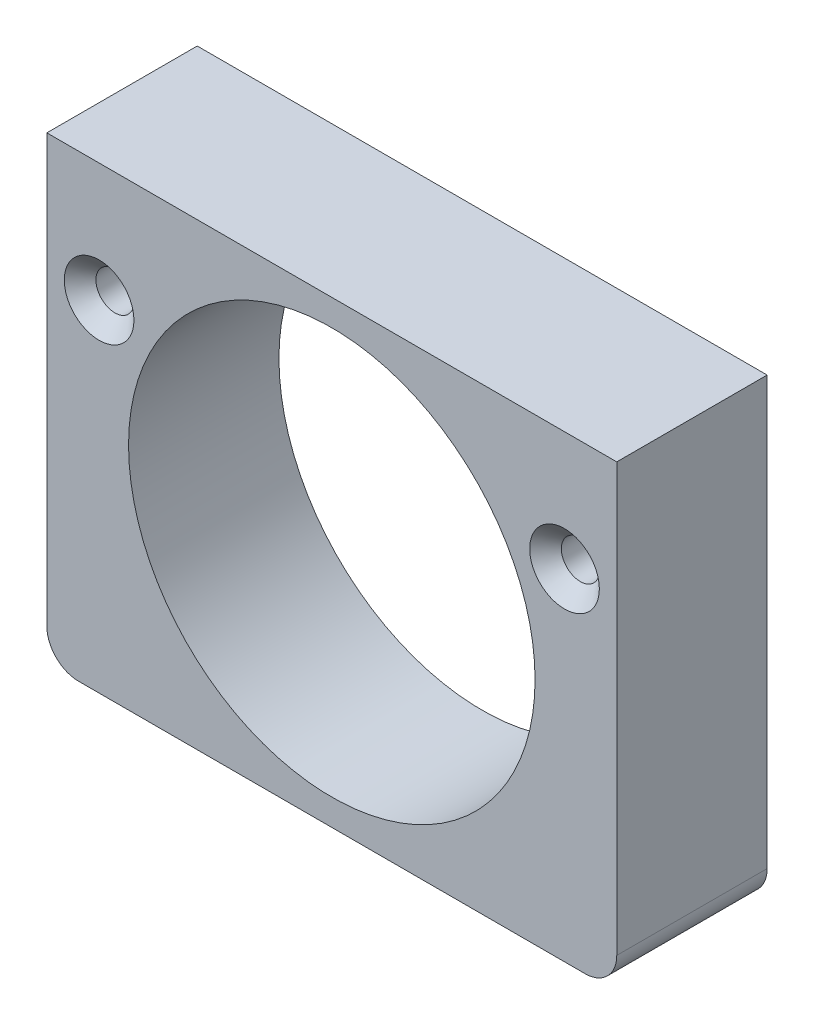
ISO-10303-21;
HEADER;
FILE_DESCRIPTION(('STEP AP214'),'2;1');
FILE_NAME('part.step','',(''),(''),'','','');
FILE_SCHEMA(('AUTOMOTIVE_DESIGN { 1 0 10303 214 1 1 1 1 }'));
ENDSEC;
DATA;
#1=APPLICATION_CONTEXT('core data for automotive mechanical design processes');
#2=APPLICATION_PROTOCOL_DEFINITION('international standard','automotive_design',2000,#1);
#3=PRODUCT_CONTEXT('',#1,'mechanical');
#4=PRODUCT('Part','Part','',(#3));
#5=PRODUCT_RELATED_PRODUCT_CATEGORY('part','',(#4));
#6=PRODUCT_DEFINITION_FORMATION('','',#4);
#7=PRODUCT_DEFINITION_CONTEXT('part definition',#1,'design');
#8=PRODUCT_DEFINITION('design','',#6,#7);
#9=PRODUCT_DEFINITION_SHAPE('','',#8);
#10=(LENGTH_UNIT() NAMED_UNIT(*) SI_UNIT(.MILLI.,.METRE.));
#11=(NAMED_UNIT(*) PLANE_ANGLE_UNIT() SI_UNIT($,.RADIAN.));
#12=(NAMED_UNIT(*) SI_UNIT($,.STERADIAN.) SOLID_ANGLE_UNIT());
#13=UNCERTAINTY_MEASURE_WITH_UNIT(LENGTH_MEASURE(1.E-05),#10,'distance_accuracy_value','');
#14=(GEOMETRIC_REPRESENTATION_CONTEXT(3) GLOBAL_UNCERTAINTY_ASSIGNED_CONTEXT((#13)) GLOBAL_UNIT_ASSIGNED_CONTEXT((#10,
#11,#12)) REPRESENTATION_CONTEXT('',''));
#15=CARTESIAN_POINT('',(0.,0.,0.));
#16=DIRECTION('',(0.,0.,1.));
#17=DIRECTION('',(1.,0.,0.));
#18=AXIS2_PLACEMENT_3D('',#15,#16,#17);
#19=CARTESIAN_POINT('',(-16.,-12.5,9.5));
#20=DIRECTION('',(0.,0.,-1.));
#21=DIRECTION('',(-1.,0.,0.));
#22=AXIS2_PLACEMENT_3D('',#19,#20,#21);
#23=PLANE('',#22);
#24=CARTESIAN_POINT('',(14.7,7.,9.5));
#25=DIRECTION('',(0.,0.,1.));
#26=DIRECTION('',(1.,0.,0.));
#27=AXIS2_PLACEMENT_3D('',#24,#25,#26);
#28=CIRCLE('',#27,2.2);
#29=CARTESIAN_POINT('',(16.9,7.,9.5));
#30=VERTEX_POINT('',#29);
#31=EDGE_CURVE('E199',#30,#30,#28,.T.);
#32=ORIENTED_EDGE('',*,*,#31,.F.);
#33=EDGE_LOOP('',(#32));
#34=FACE_BOUND('',#33,.T.);
#35=CARTESIAN_POINT('',(0.,0.,9.5));
#36=DIRECTION('',(0.,0.,1.));
#37=DIRECTION('',(1.,0.,0.));
#38=AXIS2_PLACEMENT_3D('',#35,#36,#37);
#39=CIRCLE('',#38,12.8397);
#40=CARTESIAN_POINT('',(12.8397,0.,9.5));
#41=VERTEX_POINT('',#40);
#42=EDGE_CURVE('E125',#41,#41,#39,.T.);
#43=ORIENTED_EDGE('',*,*,#42,.F.);
#44=EDGE_LOOP('',(#43));
#45=FACE_BOUND('',#44,.T.);
#46=DIRECTION('',(0.,1.,0.));
#47=VECTOR('',#46,1.);
#48=CARTESIAN_POINT('',(18.,-12.5,9.5));
#49=LINE('',#48,#47);
#50=CARTESIAN_POINT('',(18.,-12.5,9.5));
#51=VERTEX_POINT('',#50);
#52=CARTESIAN_POINT('',(18.,14.5,9.5));
#53=VERTEX_POINT('',#52);
#54=EDGE_CURVE('E132',#51,#53,#49,.T.);
#55=ORIENTED_EDGE('',*,*,#54,.T.);
#56=DIRECTION('',(-1.,0.,0.));
#57=VECTOR('',#56,1.);
#58=CARTESIAN_POINT('',(-18.,14.5,9.5));
#59=LINE('',#58,#57);
#60=CARTESIAN_POINT('',(-18.,14.5,9.5));
#61=VERTEX_POINT('',#60);
#62=EDGE_CURVE('E90',#53,#61,#59,.T.);
#63=ORIENTED_EDGE('',*,*,#62,.T.);
#64=DIRECTION('',(0.,-1.,0.));
#65=VECTOR('',#64,1.);
#66=CARTESIAN_POINT('',(-18.,-12.5,9.5));
#67=LINE('',#66,#65);
#68=CARTESIAN_POINT('',(-18.,-12.5,9.5));
#69=VERTEX_POINT('',#68);
#70=EDGE_CURVE('E103',#61,#69,#67,.T.);
#71=ORIENTED_EDGE('',*,*,#70,.T.);
#72=CARTESIAN_POINT('',(-16.,-12.5,9.5));
#73=DIRECTION('',(0.,0.,1.));
#74=DIRECTION('',(-1.,0.,0.));
#75=AXIS2_PLACEMENT_3D('',#72,#73,#74);
#76=CIRCLE('',#75,2.);
#77=CARTESIAN_POINT('',(-16.,-14.5,9.5));
#78=VERTEX_POINT('',#77);
#79=EDGE_CURVE('E97',#69,#78,#76,.T.);
#80=ORIENTED_EDGE('',*,*,#79,.T.);
#81=DIRECTION('',(1.,0.,0.));
#82=VECTOR('',#81,1.);
#83=CARTESIAN_POINT('',(-16.,-14.5,9.5));
#84=LINE('',#83,#82);
#85=CARTESIAN_POINT('',(16.,-14.5,9.5));
#86=VERTEX_POINT('',#85);
#87=EDGE_CURVE('E101',#78,#86,#84,.T.);
#88=ORIENTED_EDGE('',*,*,#87,.T.);
#89=CARTESIAN_POINT('',(16.,-12.5,9.5));
#90=DIRECTION('',(0.,0.,1.));
#91=DIRECTION('',(1.,0.,0.));
#92=AXIS2_PLACEMENT_3D('',#89,#90,#91);
#93=CIRCLE('',#92,2.);
#94=EDGE_CURVE('E53',#86,#51,#93,.T.);
#95=ORIENTED_EDGE('',*,*,#94,.T.);
#96=EDGE_LOOP('',(#55,#63,#71,#80,#88,#95));
#97=FACE_BOUND('',#96,.T.);
#98=CARTESIAN_POINT('',(-14.7,7.,9.5));
#99=DIRECTION('',(0.,0.,1.));
#100=DIRECTION('',(1.,0.,0.));
#101=AXIS2_PLACEMENT_3D('',#98,#99,#100);
#102=CIRCLE('',#101,2.2);
#103=CARTESIAN_POINT('',(-12.5,7.,9.5));
#104=VERTEX_POINT('',#103);
#105=EDGE_CURVE('E192',#104,#104,#102,.T.);
#106=ORIENTED_EDGE('',*,*,#105,.F.);
#107=EDGE_LOOP('',(#106));
#108=FACE_BOUND('',#107,.T.);
#109=ADVANCED_FACE('F36',(#34,#45,#97,#108),#23,.F.);
#110=CARTESIAN_POINT('',(18.,-12.5,9.5));
#111=DIRECTION('',(-1.,0.,0.));
#112=DIRECTION('',(0.,-1.,0.));
#113=AXIS2_PLACEMENT_3D('',#110,#111,#112);
#114=PLANE('',#113);
#115=DIRECTION('',(0.,1.,0.));
#116=VECTOR('',#115,1.);
#117=CARTESIAN_POINT('',(18.,-12.5,0.));
#118=LINE('',#117,#116);
#119=CARTESIAN_POINT('',(18.,-12.5,0.));
#120=VERTEX_POINT('',#119);
#121=CARTESIAN_POINT('',(18.,14.5,0.));
#122=VERTEX_POINT('',#121);
#123=EDGE_CURVE('E121',#120,#122,#118,.T.);
#124=ORIENTED_EDGE('',*,*,#123,.T.);
#125=DIRECTION('',(0.,0.,-1.));
#126=VECTOR('',#125,1.);
#127=CARTESIAN_POINT('',(18.,14.5,9.5));
#128=LINE('',#127,#126);
#129=EDGE_CURVE('E11',#53,#122,#128,.T.);
#130=ORIENTED_EDGE('',*,*,#129,.F.);
#131=ORIENTED_EDGE('',*,*,#54,.F.);
#132=DIRECTION('',(0.,0.,-1.));
#133=VECTOR('',#132,1.);
#134=CARTESIAN_POINT('',(18.,-12.5,9.5));
#135=LINE('',#134,#133);
#136=EDGE_CURVE('E117',#51,#120,#135,.T.);
#137=ORIENTED_EDGE('',*,*,#136,.T.);
#138=EDGE_LOOP('',(#124,#130,#131,#137));
#139=FACE_BOUND('',#138,.T.);
#140=ADVANCED_FACE('F38',(#139),#114,.F.);
#141=CARTESIAN_POINT('',(-18.,14.5,9.5));
#142=DIRECTION('',(0.,-1.,0.));
#143=DIRECTION('',(0.,0.,-1.));
#144=AXIS2_PLACEMENT_3D('',#141,#142,#143);
#145=PLANE('',#144);
#146=DIRECTION('',(-1.,0.,0.));
#147=VECTOR('',#146,1.);
#148=CARTESIAN_POINT('',(-18.,14.5,0.));
#149=LINE('',#148,#147);
#150=CARTESIAN_POINT('',(-18.,14.5,0.));
#151=VERTEX_POINT('',#150);
#152=EDGE_CURVE('E124',#122,#151,#149,.T.);
#153=ORIENTED_EDGE('',*,*,#152,.T.);
#154=DIRECTION('',(0.,0.,-1.));
#155=VECTOR('',#154,1.);
#156=CARTESIAN_POINT('',(-18.,14.5,9.5));
#157=LINE('',#156,#155);
#158=EDGE_CURVE('E45',#61,#151,#157,.T.);
#159=ORIENTED_EDGE('',*,*,#158,.F.);
#160=ORIENTED_EDGE('',*,*,#62,.F.);
#161=ORIENTED_EDGE('',*,*,#129,.T.);
#162=EDGE_LOOP('',(#153,#159,#160,#161));
#163=FACE_BOUND('',#162,.T.);
#164=ADVANCED_FACE('F162',(#163),#145,.F.);
#165=CARTESIAN_POINT('',(-18.,-12.5,9.5));
#166=DIRECTION('',(1.,0.,0.));
#167=DIRECTION('',(0.,1.,0.));
#168=AXIS2_PLACEMENT_3D('',#165,#166,#167);
#169=PLANE('',#168);
#170=DIRECTION('',(0.,-1.,0.));
#171=VECTOR('',#170,1.);
#172=CARTESIAN_POINT('',(-18.,-12.5,0.));
#173=LINE('',#172,#171);
#174=CARTESIAN_POINT('',(-18.,-12.5,0.));
#175=VERTEX_POINT('',#174);
#176=EDGE_CURVE('E127',#151,#175,#173,.T.);
#177=ORIENTED_EDGE('',*,*,#176,.T.);
#178=DIRECTION('',(0.,0.,-1.));
#179=VECTOR('',#178,1.);
#180=CARTESIAN_POINT('',(-18.,-12.5,9.5));
#181=LINE('',#180,#179);
#182=EDGE_CURVE('E112',#69,#175,#181,.T.);
#183=ORIENTED_EDGE('',*,*,#182,.F.);
#184=ORIENTED_EDGE('',*,*,#70,.F.);
#185=ORIENTED_EDGE('',*,*,#158,.T.);
#186=EDGE_LOOP('',(#177,#183,#184,#185));
#187=FACE_BOUND('',#186,.T.);
#188=ADVANCED_FACE('F138',(#187),#169,.F.);
#189=CARTESIAN_POINT('',(-16.,-12.5,9.5));
#190=DIRECTION('',(0.,0.,-1.));
#191=DIRECTION('',(-1.,0.,0.));
#192=AXIS2_PLACEMENT_3D('',#189,#190,#191);
#193=CYLINDRICAL_SURFACE('',#192,2.);
#194=CARTESIAN_POINT('',(-16.,-12.5,0.));
#195=DIRECTION('',(0.,0.,1.));
#196=DIRECTION('',(-1.,0.,0.));
#197=AXIS2_PLACEMENT_3D('',#194,#195,#196);
#198=CIRCLE('',#197,2.);
#199=CARTESIAN_POINT('',(-16.,-14.5,0.));
#200=VERTEX_POINT('',#199);
#201=EDGE_CURVE('E111',#175,#200,#198,.T.);
#202=ORIENTED_EDGE('',*,*,#201,.T.);
#203=DIRECTION('',(0.,0.,-1.));
#204=VECTOR('',#203,1.);
#205=CARTESIAN_POINT('',(-16.,-14.5,9.5));
#206=LINE('',#205,#204);
#207=EDGE_CURVE('E108',#78,#200,#206,.T.);
#208=ORIENTED_EDGE('',*,*,#207,.F.);
#209=ORIENTED_EDGE('',*,*,#79,.F.);
#210=ORIENTED_EDGE('',*,*,#182,.T.);
#211=EDGE_LOOP('',(#202,#208,#209,#210));
#212=FACE_BOUND('',#211,.T.);
#213=ADVANCED_FACE('F109',(#212),#193,.T.);
#214=CARTESIAN_POINT('',(-16.,-14.5,9.5));
#215=DIRECTION('',(0.,1.,0.));
#216=DIRECTION('',(0.,0.,1.));
#217=AXIS2_PLACEMENT_3D('',#214,#215,#216);
#218=PLANE('',#217);
#219=DIRECTION('',(1.,0.,0.));
#220=VECTOR('',#219,1.);
#221=CARTESIAN_POINT('',(-16.,-14.5,0.));
#222=LINE('',#221,#220);
#223=CARTESIAN_POINT('',(16.,-14.5,0.));
#224=VERTEX_POINT('',#223);
#225=EDGE_CURVE('E76',#200,#224,#222,.T.);
#226=ORIENTED_EDGE('',*,*,#225,.T.);
#227=DIRECTION('',(0.,0.,-1.));
#228=VECTOR('',#227,1.);
#229=CARTESIAN_POINT('',(16.,-14.5,9.5));
#230=LINE('',#229,#228);
#231=EDGE_CURVE('E113',#86,#224,#230,.T.);
#232=ORIENTED_EDGE('',*,*,#231,.F.);
#233=ORIENTED_EDGE('',*,*,#87,.F.);
#234=ORIENTED_EDGE('',*,*,#207,.T.);
#235=EDGE_LOOP('',(#226,#232,#233,#234));
#236=FACE_BOUND('',#235,.T.);
#237=ADVANCED_FACE('F115',(#236),#218,.F.);
#238=CARTESIAN_POINT('',(16.,-12.5,9.5));
#239=DIRECTION('',(0.,0.,-1.));
#240=DIRECTION('',(-1.,0.,0.));
#241=AXIS2_PLACEMENT_3D('',#238,#239,#240);
#242=CYLINDRICAL_SURFACE('',#241,2.);
#243=CARTESIAN_POINT('',(16.,-12.5,0.));
#244=DIRECTION('',(0.,0.,1.));
#245=DIRECTION('',(1.,0.,0.));
#246=AXIS2_PLACEMENT_3D('',#243,#244,#245);
#247=CIRCLE('',#246,2.);
#248=EDGE_CURVE('E82',#224,#120,#247,.T.);
#249=ORIENTED_EDGE('',*,*,#248,.T.);
#250=ORIENTED_EDGE('',*,*,#136,.F.);
#251=ORIENTED_EDGE('',*,*,#94,.F.);
#252=ORIENTED_EDGE('',*,*,#231,.T.);
#253=EDGE_LOOP('',(#249,#250,#251,#252));
#254=FACE_BOUND('',#253,.T.);
#255=ADVANCED_FACE('F145',(#254),#242,.T.);
#256=CARTESIAN_POINT('',(-16.,-12.5,0.));
#257=DIRECTION('',(0.,0.,-1.));
#258=DIRECTION('',(-1.,0.,0.));
#259=AXIS2_PLACEMENT_3D('',#256,#257,#258);
#260=PLANE('',#259);
#261=CARTESIAN_POINT('',(-14.7,7.,0.));
#262=DIRECTION('',(0.,0.,-1.));
#263=DIRECTION('',(-1.,0.,0.));
#264=AXIS2_PLACEMENT_3D('',#261,#262,#263);
#265=CIRCLE('',#264,1.2);
#266=CARTESIAN_POINT('',(-15.9,7.,0.));
#267=VERTEX_POINT('',#266);
#268=EDGE_CURVE('E194',#267,#267,#265,.T.);
#269=ORIENTED_EDGE('',*,*,#268,.F.);
#270=EDGE_LOOP('',(#269));
#271=FACE_BOUND('',#270,.T.);
#272=CARTESIAN_POINT('',(14.7,7.,0.));
#273=DIRECTION('',(0.,0.,-1.));
#274=DIRECTION('',(-1.,0.,0.));
#275=AXIS2_PLACEMENT_3D('',#272,#273,#274);
#276=CIRCLE('',#275,1.2);
#277=CARTESIAN_POINT('',(13.5,7.,0.));
#278=VERTEX_POINT('',#277);
#279=EDGE_CURVE('E205',#278,#278,#276,.T.);
#280=ORIENTED_EDGE('',*,*,#279,.F.);
#281=EDGE_LOOP('',(#280));
#282=FACE_BOUND('',#281,.T.);
#283=CARTESIAN_POINT('',(0.,0.,0.));
#284=DIRECTION('',(0.,0.,-1.));
#285=DIRECTION('',(-1.,0.,0.));
#286=AXIS2_PLACEMENT_3D('',#283,#284,#285);
#287=CIRCLE('',#286,12.8397);
#288=CARTESIAN_POINT('',(-12.8397,0.,0.));
#289=VERTEX_POINT('',#288);
#290=EDGE_CURVE('E208',#289,#289,#287,.F.);
#291=ORIENTED_EDGE('',*,*,#290,.T.);
#292=EDGE_LOOP('',(#291));
#293=FACE_BOUND('',#292,.T.);
#294=ORIENTED_EDGE('',*,*,#123,.F.);
#295=ORIENTED_EDGE('',*,*,#248,.F.);
#296=ORIENTED_EDGE('',*,*,#225,.F.);
#297=ORIENTED_EDGE('',*,*,#201,.F.);
#298=ORIENTED_EDGE('',*,*,#176,.F.);
#299=ORIENTED_EDGE('',*,*,#152,.F.);
#300=EDGE_LOOP('',(#294,#295,#296,#297,#298,#299));
#301=FACE_BOUND('',#300,.T.);
#302=ADVANCED_FACE('F141',(#271,#282,#293,#301),#260,.T.);
#303=CARTESIAN_POINT('',(0.,0.,-0.000999999999999265));
#304=DIRECTION('',(0.,0.,1.));
#305=DIRECTION('',(1.,0.,0.));
#306=AXIS2_PLACEMENT_3D('',#303,#304,#305);
#307=CYLINDRICAL_SURFACE('',#306,12.8397);
#308=ORIENTED_EDGE('',*,*,#290,.F.);
#309=EDGE_LOOP('',(#308));
#310=FACE_BOUND('',#309,.T.);
#311=ORIENTED_EDGE('',*,*,#42,.T.);
#312=EDGE_LOOP('',(#311));
#313=FACE_BOUND('',#312,.T.);
#314=ADVANCED_FACE('F152',(#310,#313),#307,.F.);
#315=CARTESIAN_POINT('',(14.7,7.,9.5));
#316=DIRECTION('',(0.,0.,1.));
#317=DIRECTION('',(1.,0.,0.));
#318=AXIS2_PLACEMENT_3D('',#315,#316,#317);
#319=CYLINDRICAL_SURFACE('',#318,1.2);
#320=CARTESIAN_POINT('',(14.7,7.,8.5));
#321=DIRECTION('',(0.,0.,1.));
#322=DIRECTION('',(1.,0.,0.));
#323=AXIS2_PLACEMENT_3D('',#320,#321,#322);
#324=CIRCLE('',#323,1.2);
#325=CARTESIAN_POINT('',(15.9,7.,8.5));
#326=VERTEX_POINT('',#325);
#327=EDGE_CURVE('E202',#326,#326,#324,.T.);
#328=ORIENTED_EDGE('',*,*,#327,.T.);
#329=EDGE_LOOP('',(#328));
#330=FACE_BOUND('',#329,.T.);
#331=ORIENTED_EDGE('',*,*,#279,.T.);
#332=EDGE_LOOP('',(#331));
#333=FACE_BOUND('',#332,.T.);
#334=ADVANCED_FACE('F168',(#330,#333),#319,.F.);
#335=CARTESIAN_POINT('',(14.7,7.,9.5));
#336=DIRECTION('',(0.,0.,1.));
#337=DIRECTION('',(1.,0.,0.));
#338=AXIS2_PLACEMENT_3D('',#335,#336,#337);
#339=CONICAL_SURFACE('',#338,2.2,0.785398163397447);
#340=ORIENTED_EDGE('',*,*,#327,.F.);
#341=EDGE_LOOP('',(#340));
#342=FACE_BOUND('',#341,.T.);
#343=ORIENTED_EDGE('',*,*,#31,.T.);
#344=EDGE_LOOP('',(#343));
#345=FACE_BOUND('',#344,.T.);
#346=ADVANCED_FACE('F172',(#342,#345),#339,.F.);
#347=CARTESIAN_POINT('',(-14.7,7.,9.5));
#348=DIRECTION('',(0.,0.,1.));
#349=DIRECTION('',(1.,0.,0.));
#350=AXIS2_PLACEMENT_3D('',#347,#348,#349);
#351=CYLINDRICAL_SURFACE('',#350,1.2);
#352=CARTESIAN_POINT('',(-14.7,7.,8.5));
#353=DIRECTION('',(0.,0.,1.));
#354=DIRECTION('',(1.,0.,0.));
#355=AXIS2_PLACEMENT_3D('',#352,#353,#354);
#356=CIRCLE('',#355,1.2);
#357=CARTESIAN_POINT('',(-13.5,7.,8.5));
#358=VERTEX_POINT('',#357);
#359=EDGE_CURVE('E189',#358,#358,#356,.T.);
#360=ORIENTED_EDGE('',*,*,#359,.T.);
#361=EDGE_LOOP('',(#360));
#362=FACE_BOUND('',#361,.T.);
#363=ORIENTED_EDGE('',*,*,#268,.T.);
#364=EDGE_LOOP('',(#363));
#365=FACE_BOUND('',#364,.T.);
#366=ADVANCED_FACE('F176',(#362,#365),#351,.F.);
#367=CARTESIAN_POINT('',(-14.7,7.,9.5));
#368=DIRECTION('',(0.,0.,1.));
#369=DIRECTION('',(1.,0.,0.));
#370=AXIS2_PLACEMENT_3D('',#367,#368,#369);
#371=CONICAL_SURFACE('',#370,2.2,0.785398163397447);
#372=ORIENTED_EDGE('',*,*,#359,.F.);
#373=EDGE_LOOP('',(#372));
#374=FACE_BOUND('',#373,.T.);
#375=ORIENTED_EDGE('',*,*,#105,.T.);
#376=EDGE_LOOP('',(#375));
#377=FACE_BOUND('',#376,.T.);
#378=ADVANCED_FACE('F180',(#374,#377),#371,.F.);
#379=CLOSED_SHELL('',(#109,#140,#164,#188,#213,#237,#255,#302,#314,#334,#346,#366,#378));
#380=MANIFOLD_SOLID_BREP('B2',#379);
#381=ADVANCED_BREP_SHAPE_REPRESENTATION('',(#18,#380),#14);
#382=SHAPE_DEFINITION_REPRESENTATION(#9,#381);
ENDSEC;
END-ISO-10303-21;
